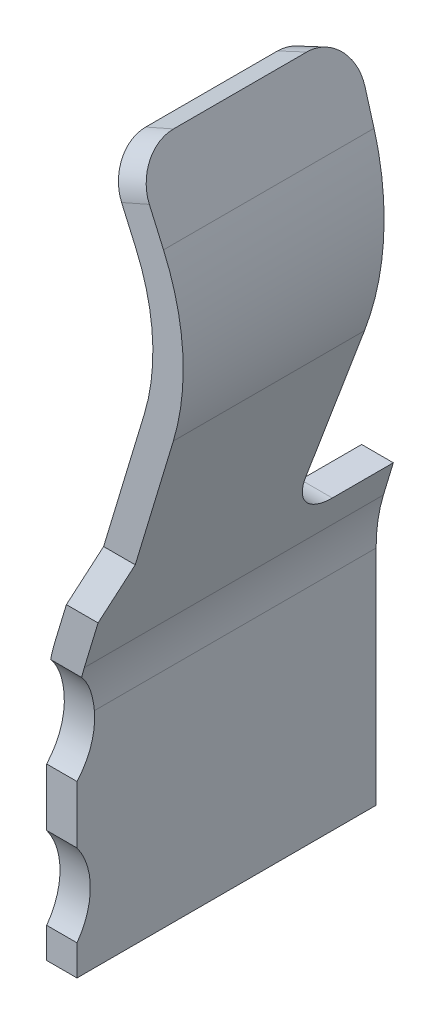
ISO-10303-21;
HEADER;
FILE_DESCRIPTION(('STEP AP214'),'2;1');
FILE_NAME('part.step','',(''),(''),'','','');
FILE_SCHEMA(('AUTOMOTIVE_DESIGN { 1 0 10303 214 1 1 1 1 }'));
ENDSEC;
DATA;
#1=APPLICATION_CONTEXT('core data for automotive mechanical design processes');
#2=APPLICATION_PROTOCOL_DEFINITION('international standard','automotive_design',2000,#1);
#3=PRODUCT_CONTEXT('',#1,'mechanical');
#4=PRODUCT('Part','Part','',(#3));
#5=PRODUCT_RELATED_PRODUCT_CATEGORY('part','',(#4));
#6=PRODUCT_DEFINITION_FORMATION('','',#4);
#7=PRODUCT_DEFINITION_CONTEXT('part definition',#1,'design');
#8=PRODUCT_DEFINITION('design','',#6,#7);
#9=PRODUCT_DEFINITION_SHAPE('','',#8);
#10=(LENGTH_UNIT() NAMED_UNIT(*) SI_UNIT(.MILLI.,.METRE.));
#11=(NAMED_UNIT(*) PLANE_ANGLE_UNIT() SI_UNIT($,.RADIAN.));
#12=(NAMED_UNIT(*) SI_UNIT($,.STERADIAN.) SOLID_ANGLE_UNIT());
#13=UNCERTAINTY_MEASURE_WITH_UNIT(LENGTH_MEASURE(1.E-05),#10,'distance_accuracy_value','');
#14=(GEOMETRIC_REPRESENTATION_CONTEXT(3) GLOBAL_UNCERTAINTY_ASSIGNED_CONTEXT((#13)) GLOBAL_UNIT_ASSIGNED_CONTEXT((#10,
#11,#12)) REPRESENTATION_CONTEXT('',''));
#15=CARTESIAN_POINT('',(0.,0.,0.));
#16=DIRECTION('',(0.,0.,1.));
#17=DIRECTION('',(1.,0.,0.));
#18=AXIS2_PLACEMENT_3D('',#15,#16,#17);
#19=CARTESIAN_POINT('',(-14.55613725867,3.53312166947706,-0.236832722369338));
#20=DIRECTION('',(-0.914255270392897,-0.402239697454475,0.0483789866630426));
#21=DIRECTION('',(0.402711251685505,-0.915327071470026,0.));
#22=AXIS2_PLACEMENT_3D('',#19,#20,#21);
#23=CYLINDRICAL_SURFACE('',#22,0.2);
#24=CARTESIAN_POINT('',(-14.5696414773253,3.50329761180303,-0.434687053017797));
#25=CARTESIAN_POINT('',(-14.6207184044719,3.6193909515076,-0.448650066039084));
#26=CARTESIAN_POINT('',(-14.6589871835182,3.70637250294574,-0.363398989614743));
#27=CARTESIAN_POINT('',(-14.6589871835182,3.70637250294574,-0.235652283248446));
#28=(BOUNDED_CURVE() B_SPLINE_CURVE(3,(#24,#25,#26,#27),.UNSPECIFIED.,.F.,
.F.) B_SPLINE_CURVE_WITH_KNOTS((4,4),(3.0320715031167,4.71238898038462),
.UNSPECIFIED.) CURVE() GEOMETRIC_REPRESENTATION_ITEM() RATIONAL_B_SPLINE_CURVE((1.,
0.778229742533871,0.778229742533871,1.)) REPRESENTATION_ITEM(''));
#29=CARTESIAN_POINT('',(-14.5696414773253,3.50329761180303,-0.434687053017797));
#30=VERTEX_POINT('',#29);
#31=CARTESIAN_POINT('',(-14.6589871835182,3.70637250294574,-0.235652283248446));
#32=VERTEX_POINT('',#31);
#33=EDGE_CURVE('E271',#30,#32,#28,.T.);
#34=ORIENTED_EDGE('',*,*,#33,.F.);
#35=DIRECTION('',(0.914255270392898,0.402239697454473,-0.0483789866630426));
#36=VECTOR('',#35,1.);
#37=CARTESIAN_POINT('',(-38.617177596038,-7.07676024092296,0.837819069551529));
#38=LINE('',#37,#36);
#39=CARTESIAN_POINT('',(-14.7069405380458,3.44289092405021,-0.427421697659669));
#40=VERTEX_POINT('',#39);
#41=EDGE_CURVE('E11',#40,#30,#38,.T.);
#42=ORIENTED_EDGE('',*,*,#41,.F.);
#43=CARTESIAN_POINT('',(-14.7962862442387,3.64596581519291,-0.228386927890318));
#44=CARTESIAN_POINT('',(-14.7962862442387,3.64596581519291,-0.356133634256616));
#45=CARTESIAN_POINT('',(-14.7580174651924,3.55898426375477,-0.441384710680957));
#46=CARTESIAN_POINT('',(-14.7069405380458,3.44289092405021,-0.427421697659669));
#47=(BOUNDED_CURVE() B_SPLINE_CURVE(3,(#43,#44,#45,#46),.UNSPECIFIED.,.F.,
.F.) B_SPLINE_CURVE_WITH_KNOTS((4,4),(1.57079632679495,3.25111380406287),
.UNSPECIFIED.) CURVE() GEOMETRIC_REPRESENTATION_ITEM() RATIONAL_B_SPLINE_CURVE((1.,
0.778229742533869,0.778229742533869,1.)) REPRESENTATION_ITEM(''));
#48=CARTESIAN_POINT('',(-14.7962862442387,3.64596581519291,-0.228386927890318));
#49=VERTEX_POINT('',#48);
#50=EDGE_CURVE('E254',#49,#40,#47,.T.);
#51=ORIENTED_EDGE('',*,*,#50,.F.);
#52=DIRECTION('',(-0.914255270392898,-0.402239697454473,0.0483789866630426));
#53=VECTOR('',#52,1.);
#54=CARTESIAN_POINT('',(-14.6366795090071,3.71618708377106,-0.236832722369339));
#55=LINE('',#54,#53);
#56=EDGE_CURVE('E265',#32,#49,#55,.T.);
#57=ORIENTED_EDGE('',*,*,#56,.F.);
#58=EDGE_LOOP('',(#34,#42,#51,#57));
#59=FACE_BOUND('',#58,.T.);
#60=ADVANCED_FACE('F16',(#59),#23,.T.);
#61=CARTESIAN_POINT('',(-14.5784449331811,3.52330708865174,0.423604352914838));
#62=DIRECTION('',(0.915327071470026,0.402711251685505,0.));
#63=DIRECTION('',(-0.402711251685505,0.915327071470026,0.));
#64=AXIS2_PLACEMENT_3D('',#61,#62,#63);
#65=CYLINDRICAL_SURFACE('',#64,0.2);
#66=CARTESIAN_POINT('',(-14.7157439939016,3.46290040089891,0.423604352914837));
#67=DIRECTION('',(-0.915327071470029,-0.402711251685498,0.));
#68=DIRECTION('',(-0.402711251685498,0.915327071470029,0.));
#69=AXIS2_PLACEMENT_3D('',#66,#67,#68);
#70=CIRCLE('',#69,0.2);
#71=CARTESIAN_POINT('',(-14.7157439939016,3.46290040089891,0.623604352914837));
#72=VERTEX_POINT('',#71);
#73=CARTESIAN_POINT('',(-14.7962862442387,3.64596581519291,0.423604352914837));
#74=VERTEX_POINT('',#73);
#75=EDGE_CURVE('E244',#72,#74,#70,.T.);
#76=ORIENTED_EDGE('',*,*,#75,.F.);
#77=DIRECTION('',(-0.915327071470027,-0.402711251685503,0.));
#78=VECTOR('',#77,1.);
#79=CARTESIAN_POINT('',(-39.3330633966531,-7.36784176638169,0.623604352914803));
#80=LINE('',#79,#78);
#81=CARTESIAN_POINT('',(-14.5784449331811,3.52330708865174,0.623604352914837));
#82=VERTEX_POINT('',#81);
#83=EDGE_CURVE('E27',#82,#72,#80,.T.);
#84=ORIENTED_EDGE('',*,*,#83,.F.);
#85=CARTESIAN_POINT('',(-14.5784449331811,3.52330708865174,0.423604352914838));
#86=DIRECTION('',(0.915327071470029,0.402711251685498,0.));
#87=DIRECTION('',(0.402711251685498,-0.915327071470029,0.));
#88=AXIS2_PLACEMENT_3D('',#85,#86,#87);
#89=CIRCLE('',#88,0.2);
#90=CARTESIAN_POINT('',(-14.6589871835182,3.70637250294574,0.423604352914837));
#91=VERTEX_POINT('',#90);
#92=EDGE_CURVE('E260',#91,#82,#89,.T.);
#93=ORIENTED_EDGE('',*,*,#92,.F.);
#94=DIRECTION('',(0.915327071470027,0.402711251685503,0.));
#95=VECTOR('',#94,1.);
#96=CARTESIAN_POINT('',(-14.6589871835182,3.70637250294574,0.423604352914837));
#97=LINE('',#96,#95);
#98=EDGE_CURVE('E257',#74,#91,#97,.T.);
#99=ORIENTED_EDGE('',*,*,#98,.F.);
#100=EDGE_LOOP('',(#76,#84,#93,#99));
#101=FACE_BOUND('',#100,.T.);
#102=ADVANCED_FACE('F258',(#101),#65,.T.);
#103=CARTESIAN_POINT('',(-43.43,1.65634067151207,-0.212546111318104));
#104=DIRECTION('',(0.,-1.,0.));
#105=DIRECTION('',(0.,0.,-1.));
#106=AXIS2_PLACEMENT_3D('',#103,#104,#105);
#107=PLANE('',#106);
#108=DIRECTION('',(0.,0.,-1.));
#109=VECTOR('',#108,1.);
#110=CARTESIAN_POINT('',(-14.8915034091056,1.65634067151207,-0.740000000000021));
#111=LINE('',#110,#109);
#112=CARTESIAN_POINT('',(-14.8915034091056,1.65634067151207,-0.438042305987955));
#113=VERTEX_POINT('',#112);
#114=CARTESIAN_POINT('',(-14.8915034091056,1.65634067151207,-0.740000000000021));
#115=VERTEX_POINT('',#114);
#116=EDGE_CURVE('E309',#113,#115,#111,.T.);
#117=ORIENTED_EDGE('',*,*,#116,.F.);
#118=DIRECTION('',(1.,0.,0.));
#119=VECTOR('',#118,1.);
#120=CARTESIAN_POINT('',(-14.7348350789415,1.65634067151207,-0.438042305987954));
#121=LINE('',#120,#119);
#122=CARTESIAN_POINT('',(-14.7348350789415,1.65634067151207,-0.438042305987954));
#123=VERTEX_POINT('',#122);
#124=EDGE_CURVE('E293',#113,#123,#121,.T.);
#125=ORIENTED_EDGE('',*,*,#124,.T.);
#126=DIRECTION('',(0.,0.,1.));
#127=VECTOR('',#126,1.);
#128=CARTESIAN_POINT('',(-14.7348350789415,1.65634067151207,-0.74000000000002));
#129=LINE('',#128,#127);
#130=CARTESIAN_POINT('',(-14.7348350789415,1.65634067151207,-0.74000000000002));
#131=VERTEX_POINT('',#130);
#132=EDGE_CURVE('E340',#131,#123,#129,.T.);
#133=ORIENTED_EDGE('',*,*,#132,.F.);
#134=DIRECTION('',(-1.,0.,0.));
#135=VECTOR('',#134,1.);
#136=CARTESIAN_POINT('',(-13.97,1.65634067151207,-0.740000000000019));
#137=LINE('',#136,#135);
#138=EDGE_CURVE('E354',#131,#115,#137,.T.);
#139=ORIENTED_EDGE('',*,*,#138,.T.);
#140=EDGE_LOOP('',(#117,#125,#133,#139));
#141=FACE_BOUND('',#140,.T.);
#142=ADVANCED_FACE('F497',(#141),#107,.F.);
#143=CARTESIAN_POINT('',(-43.43,3.70637250294571,-0.459111687165995));
#144=DIRECTION('',(0.,0.119413416546905,0.992844618230162));
#145=DIRECTION('',(1.,0.,0.));
#146=AXIS2_PLACEMENT_3D('',#143,#144,#145);
#147=PLANE('',#146);
#148=DIRECTION('',(0.286748539926818,0.951150986717315,-0.11439875574724));
#149=VECTOR('',#148,1.);
#150=CARTESIAN_POINT('',(-14.7658776351119,1.55337185451571,-0.200161637444148));
#151=LINE('',#150,#149);
#152=CARTESIAN_POINT('',(-14.6673399772696,1.88022335482146,-0.239473382341922));
#153=VERTEX_POINT('',#152);
#154=CARTESIAN_POINT('',(-14.4597982395462,2.56864369924933,-0.322272466749581));
#155=VERTEX_POINT('',#154);
#156=EDGE_CURVE('E417',#153,#155,#151,.T.);
#157=ORIENTED_EDGE('',*,*,#156,.F.);
#158=DIRECTION('',(-1.,0.,0.));
#159=VECTOR('',#158,1.);
#160=CARTESIAN_POINT('',(-14.8915034091056,1.88022335482146,-0.239473382341922));
#161=LINE('',#160,#159);
#162=CARTESIAN_POINT('',(-14.8240083074336,1.88022335482146,-0.239473382341922));
#163=VERTEX_POINT('',#162);
#164=EDGE_CURVE('E323',#153,#163,#161,.T.);
#165=ORIENTED_EDGE('',*,*,#164,.T.);
#166=DIRECTION('',(-0.28674853992682,-0.951150986717314,0.11439875574724));
#167=VECTOR('',#166,1.);
#168=CARTESIAN_POINT('',(-14.9096639548885,1.59610175610151,-0.205300934614505));
#169=LINE('',#168,#167);
#170=CARTESIAN_POINT('',(-14.6034137359037,2.61194022573825,-0.327479914176623));
#171=VERTEX_POINT('',#170);
#172=EDGE_CURVE('E526',#171,#163,#169,.T.);
#173=ORIENTED_EDGE('',*,*,#172,.F.);
#174=CARTESIAN_POINT('',(-14.6455233068166,3.30329498734983,-0.410631932744419));
#175=CARTESIAN_POINT('',(-14.5485450102924,3.08287189317973,-0.384120760424612));
#176=CARTESIAN_POINT('',(-14.5339044888234,2.84250387207174,-0.355210731501567));
#177=CARTESIAN_POINT('',(-14.6034137359037,2.61194022573825,-0.327479914176623));
#178=(BOUNDED_CURVE() B_SPLINE_CURVE(3,(#174,#175,#176,#177),.UNSPECIFIED.,.F.,
.F.) B_SPLINE_CURVE_WITH_KNOTS((4,4),(4.29791199977039,5.00519872138853),
.UNSPECIFIED.) CURVE() GEOMETRIC_REPRESENTATION_ITEM() RATIONAL_B_SPLINE_CURVE((1.,
0.958744787021091,0.958744787021091,1.)) REPRESENTATION_ITEM(''));
#179=CARTESIAN_POINT('',(-14.6455233068166,3.30329498734983,-0.410631932744419));
#180=VERTEX_POINT('',#179);
#181=EDGE_CURVE('E289',#180,#171,#178,.T.);
#182=ORIENTED_EDGE('',*,*,#181,.F.);
#183=DIRECTION('',(0.400292818236851,-0.909830186054405,0.109428936813833));
#184=VECTOR('',#183,1.);
#185=CARTESIAN_POINT('',(-14.6599508196559,3.33608744850051,-0.414576013974334));
#186=LINE('',#185,#184);
#187=EDGE_CURVE('E348',#40,#180,#186,.T.);
#188=ORIENTED_EDGE('',*,*,#187,.F.);
#189=ORIENTED_EDGE('',*,*,#41,.T.);
#190=DIRECTION('',(-0.40029281823685,0.909830186054405,-0.109428936813833));
#191=VECTOR('',#190,1.);
#192=CARTESIAN_POINT('',(-14.5223335100882,3.39577078475993,-0.421754368938235));
#193=LINE('',#192,#191);
#194=CARTESIAN_POINT('',(-14.5082242460961,3.36370167510267,-0.417897288102547));
#195=VERTEX_POINT('',#194);
#196=EDGE_CURVE('E279',#195,#30,#193,.T.);
#197=ORIENTED_EDGE('',*,*,#196,.F.);
#198=CARTESIAN_POINT('',(-14.4597982395462,2.56864369924933,-0.322272466749581));
#199=CARTESIAN_POINT('',(-14.379862605404,2.83379189253285,-0.354162906673267));
#200=CARTESIAN_POINT('',(-14.3966992050933,3.11021511680704,-0.387409439934769));
#201=CARTESIAN_POINT('',(-14.5082242460961,3.36370167510267,-0.417897288102547));
#202=(BOUNDED_CURVE() B_SPLINE_CURVE(3,(#198,#199,#200,#201),.UNSPECIFIED.,.F.,
.F.) B_SPLINE_CURVE_WITH_KNOTS((4,4),(1.27798658579106,1.98527330740919),
.UNSPECIFIED.) CURVE() GEOMETRIC_REPRESENTATION_ITEM() RATIONAL_B_SPLINE_CURVE((1.,
0.958744787021091,0.958744787021091,1.)) REPRESENTATION_ITEM(''));
#203=EDGE_CURVE('E418',#155,#195,#202,.T.);
#204=ORIENTED_EDGE('',*,*,#203,.F.);
#205=EDGE_LOOP('',(#157,#165,#173,#182,#188,#189,#197,#204));
#206=FACE_BOUND('',#205,.T.);
#207=ADVANCED_FACE('F504',(#206),#147,.F.);
#208=CARTESIAN_POINT('',(-43.43,1.94413292378283,0.623604352914797));
#209=DIRECTION('',(0.,0.,-1.));
#210=DIRECTION('',(0.,-1.,0.));
#211=AXIS2_PLACEMENT_3D('',#208,#209,#210);
#212=PLANE('',#211);
#213=DIRECTION('',(0.4027112516855,-0.915327071470028,0.));
#214=VECTOR('',#213,1.);
#215=CARTESIAN_POINT('',(-14.5082242460961,3.36370167510267,0.623604352914838));
#216=LINE('',#215,#214);
#217=CARTESIAN_POINT('',(-14.5082242460961,3.36370167510267,0.623604352914838));
#218=VERTEX_POINT('',#217);
#219=EDGE_CURVE('E290',#82,#218,#216,.T.);
#220=ORIENTED_EDGE('',*,*,#219,.F.);
#221=ORIENTED_EDGE('',*,*,#83,.T.);
#222=DIRECTION('',(-0.402711251685501,0.915327071470028,0.));
#223=VECTOR('',#222,1.);
#224=CARTESIAN_POINT('',(-14.6455233068166,3.30329498734984,0.623604352914837));
#225=LINE('',#224,#223);
#226=CARTESIAN_POINT('',(-14.6455233068166,3.30329498734983,0.623604352914837));
#227=VERTEX_POINT('',#226);
#228=EDGE_CURVE('E251',#227,#72,#225,.T.);
#229=ORIENTED_EDGE('',*,*,#228,.F.);
#230=CARTESIAN_POINT('',(-15.5608503782866,2.90058373566433,0.623604352914836));
#231=DIRECTION('',(0.,0.,1.));
#232=DIRECTION('',(-1.,0.,0.));
#233=AXIS2_PLACEMENT_3D('',#230,#231,#232);
#234=CIRCLE('',#233,1.);
#235=CARTESIAN_POINT('',(-14.6034137359037,2.61194022573825,0.623604352914837));
#236=VERTEX_POINT('',#235);
#237=EDGE_CURVE('E288',#236,#227,#234,.T.);
#238=ORIENTED_EDGE('',*,*,#237,.F.);
#239=DIRECTION('',(0.28864350992609,0.957436642382956,0.));
#240=VECTOR('',#239,1.);
#241=CARTESIAN_POINT('',(-14.927436642383,1.53714937485737,0.623604352914836));
#242=LINE('',#241,#240);
#243=CARTESIAN_POINT('',(-14.8047411502284,1.94413292378283,0.623604352914837));
#244=VERTEX_POINT('',#243);
#245=EDGE_CURVE('E525',#244,#236,#242,.T.);
#246=ORIENTED_EDGE('',*,*,#245,.F.);
#247=DIRECTION('',(1.,0.,0.));
#248=VECTOR('',#247,1.);
#249=CARTESIAN_POINT('',(-43.43,1.94413292378283,0.623604352914797));
#250=LINE('',#249,#248);
#251=CARTESIAN_POINT('',(-14.6480728200643,1.94413292378283,0.623604352914837));
#252=VERTEX_POINT('',#251);
#253=EDGE_CURVE('E357',#244,#252,#250,.T.);
#254=ORIENTED_EDGE('',*,*,#253,.T.);
#255=DIRECTION('',(-0.288643509926088,-0.957436642382956,0.));
#256=VECTOR('',#255,1.);
#257=CARTESIAN_POINT('',(-14.7838211460255,1.49385284836845,0.623604352914837));
#258=LINE('',#257,#256);
#259=CARTESIAN_POINT('',(-14.4597982395462,2.56864369924933,0.623604352914837));
#260=VERTEX_POINT('',#259);
#261=EDGE_CURVE('E433',#260,#252,#258,.T.);
#262=ORIENTED_EDGE('',*,*,#261,.F.);
#263=CARTESIAN_POINT('',(-15.5608503782866,2.90058373566433,0.623604352914836));
#264=DIRECTION('',(0.,0.,-1.));
#265=DIRECTION('',(-1.,0.,0.));
#266=AXIS2_PLACEMENT_3D('',#263,#264,#265);
#267=CIRCLE('',#266,1.15);
#268=EDGE_CURVE('E387',#218,#260,#267,.T.);
#269=ORIENTED_EDGE('',*,*,#268,.F.);
#270=EDGE_LOOP('',(#220,#221,#229,#238,#246,#254,#262,#269));
#271=FACE_BOUND('',#270,.T.);
#272=ADVANCED_FACE('F733',(#271),#212,.F.);
#273=CARTESIAN_POINT('',(-43.43,1.7003498353216,0.749999999999972));
#274=DIRECTION('',(0.,-0.460287319631494,-0.887770005906065));
#275=DIRECTION('',(0.,-0.887770005906065,0.460287319631494));
#276=AXIS2_PLACEMENT_3D('',#273,#274,#275);
#277=PLANE('',#276);
#278=ORIENTED_EDGE('',*,*,#253,.F.);
#279=DIRECTION('',(0.258541028225373,0.857586072334425,-0.444637678635293));
#280=VECTOR('',#279,1.);
#281=CARTESIAN_POINT('',(-14.7464234383064,2.13757401070795,0.523309818502746));
#282=LINE('',#281,#280);
#283=CARTESIAN_POINT('',(-14.8724210876793,1.7196371362757,0.73999999999998));
#284=VERTEX_POINT('',#283);
#285=EDGE_CURVE('E521',#284,#244,#282,.T.);
#286=ORIENTED_EDGE('',*,*,#285,.F.);
#287=DIRECTION('',(-1.,0.,0.));
#288=VECTOR('',#287,1.);
#289=CARTESIAN_POINT('',(-13.97,1.7196371362757,0.739999999999981));
#290=LINE('',#289,#288);
#291=CARTESIAN_POINT('',(-14.7157527575152,1.7196371362757,0.73999999999998));
#292=VERTEX_POINT('',#291);
#293=EDGE_CURVE('E377',#292,#284,#290,.T.);
#294=ORIENTED_EDGE('',*,*,#293,.F.);
#295=DIRECTION('',(-0.258541028225372,-0.857586072334425,0.444637678635293));
#296=VECTOR('',#295,1.);
#297=CARTESIAN_POINT('',(-14.6002273619162,2.10283732290249,0.541319952677682));
#298=LINE('',#297,#296);
#299=EDGE_CURVE('E424',#252,#292,#298,.T.);
#300=ORIENTED_EDGE('',*,*,#299,.F.);
#301=EDGE_LOOP('',(#278,#286,#294,#300));
#302=FACE_BOUND('',#301,.T.);
#303=ADVANCED_FACE('F728',(#302),#277,.F.);
#304=CARTESIAN_POINT('',(-13.97,1.24850586493128,0.739999999999981));
#305=DIRECTION('',(0.,0.,-1.));
#306=DIRECTION('',(0.,-1.,0.));
#307=AXIS2_PLACEMENT_3D('',#304,#305,#306);
#308=PLANE('',#307);
#309=DIRECTION('',(0.,1.,0.));
#310=VECTOR('',#309,1.);
#311=CARTESIAN_POINT('',(-14.82,0.145965815192914,0.73999999999998));
#312=LINE('',#311,#310);
#313=CARTESIAN_POINT('',(-14.82,0.145965815192914,0.73999999999998));
#314=VERTEX_POINT('',#313);
#315=CARTESIAN_POINT('',(-14.82,0.296740599868486,0.73999999999998));
#316=VERTEX_POINT('',#315);
#317=EDGE_CURVE('E388',#314,#316,#312,.T.);
#318=ORIENTED_EDGE('',*,*,#317,.T.);
#319=DIRECTION('',(-1.,0.,0.));
#320=VECTOR('',#319,1.);
#321=CARTESIAN_POINT('',(-43.43,0.296740599868486,0.73999999999994));
#322=LINE('',#321,#320);
#323=CARTESIAN_POINT('',(-14.97,0.296740599868486,0.739999999999979));
#324=VERTEX_POINT('',#323);
#325=EDGE_CURVE('E330',#316,#324,#322,.T.);
#326=ORIENTED_EDGE('',*,*,#325,.T.);
#327=DIRECTION('',(0.,-1.,0.));
#328=VECTOR('',#327,1.);
#329=CARTESIAN_POINT('',(-14.97,0.145965815192914,0.739999999999979));
#330=LINE('',#329,#328);
#331=CARTESIAN_POINT('',(-14.97,0.145965815192914,0.739999999999979));
#332=VERTEX_POINT('',#331);
#333=EDGE_CURVE('E335',#324,#332,#330,.T.);
#334=ORIENTED_EDGE('',*,*,#333,.T.);
#335=DIRECTION('',(1.,0.,0.));
#336=VECTOR('',#335,1.);
#337=CARTESIAN_POINT('',(-14.82,0.145965815192914,0.73999999999998));
#338=LINE('',#337,#336);
#339=EDGE_CURVE('E312',#332,#314,#338,.T.);
#340=ORIENTED_EDGE('',*,*,#339,.T.);
#341=EDGE_LOOP('',(#318,#326,#334,#340));
#342=FACE_BOUND('',#341,.T.);
#343=ADVANCED_FACE('F732',(#342),#308,.F.);
#344=CARTESIAN_POINT('',(-13.97,1.24850586493128,-0.740000000000019));
#345=DIRECTION('',(0.,0.,-1.));
#346=DIRECTION('',(0.,-1.,0.));
#347=AXIS2_PLACEMENT_3D('',#344,#345,#346);
#348=PLANE('',#347);
#349=ORIENTED_EDGE('',*,*,#138,.F.);
#350=DIRECTION('',(0.288643509926088,0.957436642382956,0.));
#351=VECTOR('',#350,1.);
#352=CARTESIAN_POINT('',(-14.7838211460255,1.49385284836845,-0.74000000000002));
#353=LINE('',#352,#351);
#354=CARTESIAN_POINT('',(-14.7838211460255,1.49385284836845,-0.74000000000002));
#355=VERTEX_POINT('',#354);
#356=EDGE_CURVE('E337',#355,#131,#353,.T.);
#357=ORIENTED_EDGE('',*,*,#356,.F.);
#358=CARTESIAN_POINT('',(-13.97,1.24850586493128,-0.740000000000019));
#359=DIRECTION('',(0.,0.,-1.));
#360=DIRECTION('',(1.,0.,0.));
#361=AXIS2_PLACEMENT_3D('',#358,#359,#360);
#362=CIRCLE('',#361,0.85);
#363=CARTESIAN_POINT('',(-14.82,1.24850586493128,-0.74000000000002));
#364=VERTEX_POINT('',#363);
#365=EDGE_CURVE('E299',#364,#355,#362,.T.);
#366=ORIENTED_EDGE('',*,*,#365,.F.);
#367=DIRECTION('',(0.,1.,0.));
#368=VECTOR('',#367,1.);
#369=CARTESIAN_POINT('',(-14.82,0.145965815192914,-0.74000000000002));
#370=LINE('',#369,#368);
#371=CARTESIAN_POINT('',(-14.82,0.145965815192914,-0.74000000000002));
#372=VERTEX_POINT('',#371);
#373=EDGE_CURVE('E304',#372,#364,#370,.T.);
#374=ORIENTED_EDGE('',*,*,#373,.F.);
#375=DIRECTION('',(1.,0.,0.));
#376=VECTOR('',#375,1.);
#377=CARTESIAN_POINT('',(-14.82,0.145965815192914,-0.74000000000002));
#378=LINE('',#377,#376);
#379=CARTESIAN_POINT('',(-14.97,0.145965815192914,-0.740000000000021));
#380=VERTEX_POINT('',#379);
#381=EDGE_CURVE('E402',#380,#372,#378,.T.);
#382=ORIENTED_EDGE('',*,*,#381,.F.);
#383=DIRECTION('',(0.,-1.,0.));
#384=VECTOR('',#383,1.);
#385=CARTESIAN_POINT('',(-14.97,0.145965815192914,-0.740000000000021));
#386=LINE('',#385,#384);
#387=CARTESIAN_POINT('',(-14.97,1.24850586493128,-0.740000000000021));
#388=VERTEX_POINT('',#387);
#389=EDGE_CURVE('E42',#388,#380,#386,.T.);
#390=ORIENTED_EDGE('',*,*,#389,.F.);
#391=CARTESIAN_POINT('',(-13.97,1.24850586493128,-0.740000000000019));
#392=DIRECTION('',(0.,0.,1.));
#393=DIRECTION('',(1.,0.,0.));
#394=AXIS2_PLACEMENT_3D('',#391,#392,#393);
#395=CIRCLE('',#394,1.);
#396=CARTESIAN_POINT('',(-14.927436642383,1.53714937485737,-0.740000000000021));
#397=VERTEX_POINT('',#396);
#398=EDGE_CURVE('E336',#397,#388,#395,.T.);
#399=ORIENTED_EDGE('',*,*,#398,.F.);
#400=DIRECTION('',(-0.28864350992609,-0.957436642382956,0.));
#401=VECTOR('',#400,1.);
#402=CARTESIAN_POINT('',(-14.927436642383,1.53714937485737,-0.740000000000021));
#403=LINE('',#402,#401);
#404=EDGE_CURVE('E305',#115,#397,#403,.T.);
#405=ORIENTED_EDGE('',*,*,#404,.F.);
#406=EDGE_LOOP('',(#349,#357,#366,#374,#382,#390,#399,#405));
#407=FACE_BOUND('',#406,.T.);
#408=ADVANCED_FACE('F742',(#407),#348,.T.);
#409=CARTESIAN_POINT('',(-14.97,0.145965815192914,-0.740000000000021));
#410=DIRECTION('',(1.,0.,0.));
#411=DIRECTION('',(0.,1.,0.));
#412=AXIS2_PLACEMENT_3D('',#409,#410,#411);
#413=PLANE('',#412);
#414=DIRECTION('',(0.,-1.,0.));
#415=VECTOR('',#414,1.);
#416=CARTESIAN_POINT('',(-14.97,0.145965815192914,0.739999999999979));
#417=LINE('',#416,#415);
#418=CARTESIAN_POINT('',(-14.97,0.988055123608201,0.739999999999979));
#419=VERTEX_POINT('',#418);
#420=CARTESIAN_POINT('',(-14.97,0.703259400131467,0.739999999999979));
#421=VERTEX_POINT('',#420);
#422=EDGE_CURVE('E317',#419,#421,#417,.T.);
#423=ORIENTED_EDGE('',*,*,#422,.F.);
#424=CARTESIAN_POINT('',(-14.97,1.21669179396546,0.995153761033096));
#425=DIRECTION('',(1.,0.,0.));
#426=DIRECTION('',(0.,1.,0.));
#427=AXIS2_PLACEMENT_3D('',#424,#425,#426);
#428=CIRCLE('',#427,0.342604974863759);
#429=CARTESIAN_POINT('',(-14.97,1.24850586493128,0.654029100989324));
#430=VERTEX_POINT('',#429);
#431=EDGE_CURVE('E401',#419,#430,#428,.T.);
#432=ORIENTED_EDGE('',*,*,#431,.T.);
#433=DIRECTION('',(0.,0.,1.));
#434=VECTOR('',#433,1.);
#435=CARTESIAN_POINT('',(-14.97,1.24850586493128,-0.740000000000021));
#436=LINE('',#435,#434);
#437=EDGE_CURVE('E397',#388,#430,#436,.T.);
#438=ORIENTED_EDGE('',*,*,#437,.F.);
#439=ORIENTED_EDGE('',*,*,#389,.T.);
#440=DIRECTION('',(0.,0.,1.));
#441=VECTOR('',#440,1.);
#442=CARTESIAN_POINT('',(-14.97,0.145965815192914,-0.740000000000021));
#443=LINE('',#442,#441);
#444=EDGE_CURVE('E316',#380,#332,#443,.T.);
#445=ORIENTED_EDGE('',*,*,#444,.T.);
#446=ORIENTED_EDGE('',*,*,#333,.F.);
#447=CARTESIAN_POINT('',(-14.97,0.499999999999977,1.0194268345702));
#448=DIRECTION('',(1.,0.,0.));
#449=DIRECTION('',(0.,1.,0.));
#450=AXIS2_PLACEMENT_3D('',#447,#448,#449);
#451=CIRCLE('',#450,0.345533991988848);
#452=EDGE_CURVE('E324',#324,#421,#451,.T.);
#453=ORIENTED_EDGE('',*,*,#452,.T.);
#454=EDGE_LOOP('',(#423,#432,#438,#439,#445,#446,#453));
#455=FACE_BOUND('',#454,.T.);
#456=ADVANCED_FACE('F490',(#455),#413,.F.);
#457=CARTESIAN_POINT('',(-13.97,1.24850586493128,-0.740000000000019));
#458=DIRECTION('',(0.,0.,1.));
#459=DIRECTION('',(-1.,0.,0.));
#460=AXIS2_PLACEMENT_3D('',#457,#458,#459);
#461=CYLINDRICAL_SURFACE('',#460,1.);
#462=ORIENTED_EDGE('',*,*,#437,.T.);
#463=CARTESIAN_POINT('',(-14.97,1.24850586493127,0.654029100989324));
#464=CARTESIAN_POINT('',(-14.9700000740736,1.25306932177748,0.654454497923835));
#465=CARTESIAN_POINT('',(-14.9699687647214,1.25762446546712,0.654969794425774));
#466=CARTESIAN_POINT('',(-14.9698448349043,1.26669234380872,0.656178662703507));
#467=CARTESIAN_POINT('',(-14.969752450797,1.27120517419842,0.656871540938563));
#468=CARTESIAN_POINT('',(-14.9695080867068,1.28018764830056,0.658435530000101));
#469=CARTESIAN_POINT('',(-14.9693562428961,1.28465736694881,0.659306231418194));
#470=CARTESIAN_POINT('',(-14.968994777031,1.29355289226453,0.661225514697385));
#471=CARTESIAN_POINT('',(-14.9687851944591,1.29797872680563,0.66227397481712));
#472=CARTESIAN_POINT('',(-14.9683100279271,1.30678583476397,0.664548502475786));
#473=CARTESIAN_POINT('',(-14.968044392526,1.31116706334694,0.665774732832754));
#474=CARTESIAN_POINT('',(-14.9674588915288,1.31988437499395,0.668404514864849));
#475=CARTESIAN_POINT('',(-14.9671388909946,1.32422031651338,0.669808505488944));
#476=CARTESIAN_POINT('',(-14.9664464106962,1.33284654509273,0.672793524574298));
#477=CARTESIAN_POINT('',(-14.9660737213731,1.33713657245114,0.67437525453736));
#478=CARTESIAN_POINT('',(-14.9652776024185,1.34567049059148,0.677715533217567));
#479=CARTESIAN_POINT('',(-14.964853898673,1.34991398511754,0.679475028174295));
#480=CARTESIAN_POINT('',(-14.9639632184939,1.35830019523904,0.683146652073494));
#481=CARTESIAN_POINT('',(-14.9634965071956,1.36244335249443,0.685057836907499));
#482=CARTESIAN_POINT('',(-14.962523128602,1.37063194178074,0.6890335315101));
#483=CARTESIAN_POINT('',(-14.9620166121166,1.3746776733665,0.691097460992356));
#484=CARTESIAN_POINT('',(-14.9609671316824,1.38267128376232,0.695378434355305));
#485=CARTESIAN_POINT('',(-14.9604242473526,1.3866193519919,0.69759514404689));
#486=CARTESIAN_POINT('',(-14.9593054429822,1.39441764648526,0.702181418874191));
#487=CARTESIAN_POINT('',(-14.9587295429944,1.39826793013232,0.704550891332612));
#488=CARTESIAN_POINT('',(-14.957548029628,1.40587073759695,0.709442454924467));
#489=CARTESIAN_POINT('',(-14.9569423891828,1.40962316741917,0.711964685588729));
#490=CARTESIAN_POINT('',(-14.9557046207364,1.4170304504751,0.717161525963165));
#491=CARTESIAN_POINT('',(-14.955072431473,1.42068504210779,0.719836493879691));
#492=CARTESIAN_POINT('',(-14.9537847065422,1.42789683764576,0.725338623347788));
#493=CARTESIAN_POINT('',(-14.9531290884707,1.43145359950846,0.728166344681211));
#494=CARTESIAN_POINT('',(-14.9517975159458,1.43847023752972,0.733973670299352));
#495=CARTESIAN_POINT('',(-14.951121470501,1.44192948379825,0.736954014976151));
#496=CARTESIAN_POINT('',(-14.9504391181347,1.44532846432271,0.73999999999998));
#497=B_SPLINE_CURVE_WITH_KNOTS('',3,(#463,#464,#465,#466,#467,#468,#469,#470,#471,#472,#473,
#474,#475,#476,#477,#478,#479,#480,#481,#482,#483,#484,#485,#486,#487,#488,#489,#490,#491,#492,
#493,#494,#495,#496),.UNSPECIFIED.,.F.,.F.,(4,2,2,2,2,2,2,2,2,2,2,2,2,2,2,2,4),(0.,
0.013748827736232,0.0274447569667543,0.0411095020469267,0.0547649260984996,0.0684329369744623,
0.0821353821572885,0.0958939450956066,0.109730045405059,0.123485924962941,0.137191991355335,
0.150868974599205,0.164537737053089,0.17821917870054,0.191934141578145,0.205703315519925,
0.219547147320743),.UNSPECIFIED.);
#498=CARTESIAN_POINT('',(-14.9504391181347,1.44532846432271,0.739999999999979));
#499=VERTEX_POINT('',#498);
#500=EDGE_CURVE('E331',#430,#499,#497,.T.);
#501=ORIENTED_EDGE('',*,*,#500,.T.);
#502=CARTESIAN_POINT('',(-13.97,1.24850586493128,0.739999999999981));
#503=DIRECTION('',(0.,0.,1.));
#504=DIRECTION('',(1.,0.,0.));
#505=AXIS2_PLACEMENT_3D('',#502,#503,#504);
#506=CIRCLE('',#505,1.);
#507=CARTESIAN_POINT('',(-14.927436642383,1.53714937485737,0.739999999999979));
#508=VERTEX_POINT('',#507);
#509=EDGE_CURVE('E457',#508,#499,#506,.T.);
#510=ORIENTED_EDGE('',*,*,#509,.F.);
#511=DIRECTION('',(0.,0.,1.));
#512=VECTOR('',#511,1.);
#513=CARTESIAN_POINT('',(-14.927436642383,1.53714937485737,-0.740000000000021));
#514=LINE('',#513,#512);
#515=EDGE_CURVE('E283',#397,#508,#514,.T.);
#516=ORIENTED_EDGE('',*,*,#515,.F.);
#517=ORIENTED_EDGE('',*,*,#398,.T.);
#518=EDGE_LOOP('',(#462,#501,#510,#516,#517));
#519=FACE_BOUND('',#518,.T.);
#520=ADVANCED_FACE('F480',(#519),#461,.T.);
#521=CARTESIAN_POINT('',(-14.927436642383,1.53714937485737,-0.740000000000021));
#522=DIRECTION('',(0.957436642382956,-0.28864350992609,0.));
#523=DIRECTION('',(0.,0.,-1.));
#524=AXIS2_PLACEMENT_3D('',#521,#522,#523);
#525=PLANE('',#524);
#526=ORIENTED_EDGE('',*,*,#172,.T.);
#527=CARTESIAN_POINT('',(-14.8240083074336,1.88022335482146,-0.239473382341922));
#528=CARTESIAN_POINT('',(-14.8263982742986,1.87229578405696,-0.238519901512672));
#529=CARTESIAN_POINT('',(-14.8288011555845,1.86432537588468,-0.238042305987954));
#530=CARTESIAN_POINT('',(-14.8312083468218,1.85634067151208,-0.238042305987954));
#531=(BOUNDED_CURVE() B_SPLINE_CURVE(3,(#527,#528,#529,#530),.UNSPECIFIED.,.F.,
.F.) B_SPLINE_CURVE_WITH_KNOTS((4,4),(4.59268992994791,4.71238898038469),
.UNSPECIFIED.) CURVE() GEOMETRIC_REPRESENTATION_ITEM() RATIONAL_B_SPLINE_CURVE((1.,
0.998806367803328,0.998806367803328,1.)) REPRESENTATION_ITEM(''));
#532=CARTESIAN_POINT('',(-14.8312083468218,1.85634067151208,-0.238042305987954));
#533=VERTEX_POINT('',#532);
#534=EDGE_CURVE('E318',#163,#533,#531,.T.);
#535=ORIENTED_EDGE('',*,*,#534,.T.);
#536=CARTESIAN_POINT('',(-14.8312083468218,1.85634067151208,-0.238042305987954));
#537=CARTESIAN_POINT('',(-14.8665283765635,1.73918338398669,-0.238042305987954));
#538=CARTESIAN_POINT('',(-14.8915034091056,1.65634067151208,-0.320885018462573));
#539=CARTESIAN_POINT('',(-14.8915034091056,1.65634067151207,-0.438042305987955));
#540=(BOUNDED_CURVE() B_SPLINE_CURVE(3,(#536,#537,#538,#539),.UNSPECIFIED.,.F.,
.F.) B_SPLINE_CURVE_WITH_KNOTS((4,4),(4.71238898038469,6.28318530717959),
.UNSPECIFIED.) CURVE() GEOMETRIC_REPRESENTATION_ITEM() RATIONAL_B_SPLINE_CURVE((1.,
0.804737854124365,0.804737854124365,1.)) REPRESENTATION_ITEM(''));
#541=EDGE_CURVE('E297',#533,#113,#540,.T.);
#542=ORIENTED_EDGE('',*,*,#541,.T.);
#543=ORIENTED_EDGE('',*,*,#116,.T.);
#544=ORIENTED_EDGE('',*,*,#404,.T.);
#545=ORIENTED_EDGE('',*,*,#515,.T.);
#546=DIRECTION('',(-0.28864350992609,-0.957436642382956,0.));
#547=VECTOR('',#546,1.);
#548=CARTESIAN_POINT('',(-14.927436642383,1.53714937485737,0.739999999999979));
#549=LINE('',#548,#547);
#550=EDGE_CURVE('E384',#284,#508,#549,.T.);
#551=ORIENTED_EDGE('',*,*,#550,.F.);
#552=ORIENTED_EDGE('',*,*,#285,.T.);
#553=ORIENTED_EDGE('',*,*,#245,.T.);
#554=DIRECTION('',(0.,0.,1.));
#555=VECTOR('',#554,1.);
#556=CARTESIAN_POINT('',(-14.6034137359037,2.61194022573825,-0.74000000000002));
#557=LINE('',#556,#555);
#558=EDGE_CURVE('E285',#171,#236,#557,.T.);
#559=ORIENTED_EDGE('',*,*,#558,.F.);
#560=EDGE_LOOP('',(#526,#535,#542,#543,#544,#545,#551,#552,#553,#559));
#561=FACE_BOUND('',#560,.T.);
#562=ADVANCED_FACE('F489',(#561),#525,.F.);
#563=CARTESIAN_POINT('',(-15.5608503782866,2.90058373566433,-0.740000000000021));
#564=DIRECTION('',(0.,0.,1.));
#565=DIRECTION('',(-1.,0.,0.));
#566=AXIS2_PLACEMENT_3D('',#563,#564,#565);
#567=CYLINDRICAL_SURFACE('',#566,1.);
#568=DIRECTION('',(0.,0.,1.));
#569=VECTOR('',#568,1.);
#570=CARTESIAN_POINT('',(-14.6455233068166,3.30329498734983,-0.74000000000002));
#571=LINE('',#570,#569);
#572=EDGE_CURVE('E345',#180,#227,#571,.T.);
#573=ORIENTED_EDGE('',*,*,#572,.F.);
#574=ORIENTED_EDGE('',*,*,#181,.T.);
#575=ORIENTED_EDGE('',*,*,#558,.T.);
#576=ORIENTED_EDGE('',*,*,#237,.T.);
#577=EDGE_LOOP('',(#573,#574,#575,#576));
#578=FACE_BOUND('',#577,.T.);
#579=ADVANCED_FACE('F18',(#578),#567,.F.);
#580=CARTESIAN_POINT('',(-14.6455233068166,3.30329498734984,-0.74000000000002));
#581=DIRECTION('',(0.915327071470028,0.402711251685501,0.));
#582=DIRECTION('',(0.,0.,-1.));
#583=AXIS2_PLACEMENT_3D('',#580,#581,#582);
#584=PLANE('',#583);
#585=ORIENTED_EDGE('',*,*,#228,.T.);
#586=ORIENTED_EDGE('',*,*,#75,.T.);
#587=DIRECTION('',(0.,0.,1.));
#588=VECTOR('',#587,1.);
#589=CARTESIAN_POINT('',(-14.7962862442387,3.64596581519291,-0.740000000000021));
#590=LINE('',#589,#588);
#591=EDGE_CURVE('E249',#49,#74,#590,.T.);
#592=ORIENTED_EDGE('',*,*,#591,.F.);
#593=ORIENTED_EDGE('',*,*,#50,.T.);
#594=ORIENTED_EDGE('',*,*,#187,.T.);
#595=ORIENTED_EDGE('',*,*,#572,.T.);
#596=EDGE_LOOP('',(#585,#586,#592,#593,#594,#595));
#597=FACE_BOUND('',#596,.T.);
#598=ADVANCED_FACE('F246',(#597),#584,.F.);
#599=CARTESIAN_POINT('',(-14.6589871835182,3.70637250294574,-0.74000000000002));
#600=DIRECTION('',(0.402711251685503,-0.915327071470027,0.));
#601=DIRECTION('',(0.,0.,-1.));
#602=AXIS2_PLACEMENT_3D('',#599,#600,#601);
#603=PLANE('',#602);
#604=ORIENTED_EDGE('',*,*,#591,.T.);
#605=ORIENTED_EDGE('',*,*,#98,.T.);
#606=DIRECTION('',(0.,0.,1.));
#607=VECTOR('',#606,1.);
#608=CARTESIAN_POINT('',(-14.6589871835182,3.70637250294574,-0.74000000000002));
#609=LINE('',#608,#607);
#610=EDGE_CURVE('E353',#32,#91,#609,.T.);
#611=ORIENTED_EDGE('',*,*,#610,.F.);
#612=ORIENTED_EDGE('',*,*,#56,.T.);
#613=EDGE_LOOP('',(#604,#605,#611,#612));
#614=FACE_BOUND('',#613,.T.);
#615=ADVANCED_FACE('F268',(#614),#603,.F.);
#616=CARTESIAN_POINT('',(-14.5082242460961,3.36370167510267,-0.74000000000002));
#617=DIRECTION('',(-0.915327071470028,-0.4027112516855,0.));
#618=DIRECTION('',(-0.4027112516855,0.915327071470028,0.));
#619=AXIS2_PLACEMENT_3D('',#616,#617,#618);
#620=PLANE('',#619);
#621=ORIENTED_EDGE('',*,*,#610,.T.);
#622=ORIENTED_EDGE('',*,*,#92,.T.);
#623=ORIENTED_EDGE('',*,*,#219,.T.);
#624=DIRECTION('',(0.,0.,1.));
#625=VECTOR('',#624,1.);
#626=CARTESIAN_POINT('',(-14.5082242460961,3.36370167510267,-0.74000000000002));
#627=LINE('',#626,#625);
#628=EDGE_CURVE('E394',#195,#218,#627,.T.);
#629=ORIENTED_EDGE('',*,*,#628,.F.);
#630=ORIENTED_EDGE('',*,*,#196,.T.);
#631=ORIENTED_EDGE('',*,*,#33,.T.);
#632=EDGE_LOOP('',(#621,#622,#623,#629,#630,#631));
#633=FACE_BOUND('',#632,.T.);
#634=ADVANCED_FACE('F501',(#633),#620,.F.);
#635=CARTESIAN_POINT('',(-15.5608503782866,2.90058373566433,-0.740000000000021));
#636=DIRECTION('',(0.,0.,1.));
#637=DIRECTION('',(-1.,0.,0.));
#638=AXIS2_PLACEMENT_3D('',#635,#636,#637);
#639=CYLINDRICAL_SURFACE('',#638,1.15);
#640=DIRECTION('',(0.,0.,1.));
#641=VECTOR('',#640,1.);
#642=CARTESIAN_POINT('',(-14.4597982395462,2.56864369924933,-0.74000000000002));
#643=LINE('',#642,#641);
#644=EDGE_CURVE('E440',#155,#260,#643,.T.);
#645=ORIENTED_EDGE('',*,*,#644,.F.);
#646=ORIENTED_EDGE('',*,*,#203,.T.);
#647=ORIENTED_EDGE('',*,*,#628,.T.);
#648=ORIENTED_EDGE('',*,*,#268,.T.);
#649=EDGE_LOOP('',(#645,#646,#647,#648));
#650=FACE_BOUND('',#649,.T.);
#651=ADVANCED_FACE('F751',(#650),#639,.T.);
#652=CARTESIAN_POINT('',(-14.7838211460255,1.49385284836845,-0.74000000000002));
#653=DIRECTION('',(-0.957436642382956,0.288643509926088,0.));
#654=DIRECTION('',(0.,0.,1.));
#655=AXIS2_PLACEMENT_3D('',#652,#653,#654);
#656=PLANE('',#655);
#657=ORIENTED_EDGE('',*,*,#356,.T.);
#658=ORIENTED_EDGE('',*,*,#132,.T.);
#659=CARTESIAN_POINT('',(-14.7348350789415,1.65634067151207,-0.438042305987954));
#660=CARTESIAN_POINT('',(-14.7348350789415,1.65634067151208,-0.320885018462573));
#661=CARTESIAN_POINT('',(-14.7098600463995,1.73918338398669,-0.238042305987954));
#662=CARTESIAN_POINT('',(-14.6745400166578,1.85634067151208,-0.238042305987954));
#663=(BOUNDED_CURVE() B_SPLINE_CURVE(3,(#659,#660,#661,#662),.UNSPECIFIED.,.F.,
.F.) B_SPLINE_CURVE_WITH_KNOTS((4,4),(0.,1.5707963267949),
.UNSPECIFIED.) CURVE() GEOMETRIC_REPRESENTATION_ITEM() RATIONAL_B_SPLINE_CURVE((1.,
0.804737854124365,0.804737854124365,1.)) REPRESENTATION_ITEM(''));
#664=CARTESIAN_POINT('',(-14.6745400166578,1.85634067151208,-0.238042305987954));
#665=VERTEX_POINT('',#664);
#666=EDGE_CURVE('E298',#123,#665,#663,.T.);
#667=ORIENTED_EDGE('',*,*,#666,.T.);
#668=CARTESIAN_POINT('',(-14.6745400166578,1.85634067151208,-0.238042305987954));
#669=CARTESIAN_POINT('',(-14.6721328254205,1.86432537588468,-0.238042305987954));
#670=CARTESIAN_POINT('',(-14.6697299441346,1.87229578405696,-0.238519901512672));
#671=CARTESIAN_POINT('',(-14.6673399772696,1.88022335482146,-0.239473382341922));
#672=(BOUNDED_CURVE() B_SPLINE_CURVE(3,(#668,#669,#670,#671),.UNSPECIFIED.,.F.,
.F.) B_SPLINE_CURVE_WITH_KNOTS((4,4),(1.5707963267949,1.69049537723168),
.UNSPECIFIED.) CURVE() GEOMETRIC_REPRESENTATION_ITEM() RATIONAL_B_SPLINE_CURVE((1.,
0.998806367803328,0.998806367803328,1.)) REPRESENTATION_ITEM(''));
#673=EDGE_CURVE('E376',#665,#153,#672,.T.);
#674=ORIENTED_EDGE('',*,*,#673,.T.);
#675=ORIENTED_EDGE('',*,*,#156,.T.);
#676=ORIENTED_EDGE('',*,*,#644,.T.);
#677=ORIENTED_EDGE('',*,*,#261,.T.);
#678=ORIENTED_EDGE('',*,*,#299,.T.);
#679=DIRECTION('',(0.288643509926088,0.957436642382956,0.));
#680=VECTOR('',#679,1.);
#681=CARTESIAN_POINT('',(-14.7838211460255,1.49385284836845,0.73999999999998));
#682=LINE('',#681,#680);
#683=CARTESIAN_POINT('',(-14.7838211460255,1.49385284836845,0.73999999999998));
#684=VERTEX_POINT('',#683);
#685=EDGE_CURVE('E368',#684,#292,#682,.T.);
#686=ORIENTED_EDGE('',*,*,#685,.F.);
#687=DIRECTION('',(0.,0.,1.));
#688=VECTOR('',#687,1.);
#689=CARTESIAN_POINT('',(-14.7838211460255,1.49385284836845,-0.74000000000002));
#690=LINE('',#689,#688);
#691=EDGE_CURVE('E303',#355,#684,#690,.T.);
#692=ORIENTED_EDGE('',*,*,#691,.F.);
#693=EDGE_LOOP('',(#657,#658,#667,#674,#675,#676,#677,#678,#686,#692));
#694=FACE_BOUND('',#693,.T.);
#695=ADVANCED_FACE('F810',(#694),#656,.F.);
#696=CARTESIAN_POINT('',(-13.97,1.24850586493128,-0.740000000000019));
#697=DIRECTION('',(0.,0.,1.));
#698=DIRECTION('',(-1.,0.,0.));
#699=AXIS2_PLACEMENT_3D('',#696,#697,#698);
#700=CYLINDRICAL_SURFACE('',#699,0.85);
#701=CARTESIAN_POINT('',(-13.97,1.24850586493128,0.739999999999981));
#702=DIRECTION('',(0.,0.,-1.));
#703=DIRECTION('',(1.,0.,0.));
#704=AXIS2_PLACEMENT_3D('',#701,#702,#703);
#705=CIRCLE('',#704,0.85);
#706=CARTESIAN_POINT('',(-14.7968983398029,1.44532846432271,0.73999999999998));
#707=VERTEX_POINT('',#706);
#708=EDGE_CURVE('E125',#707,#684,#705,.T.);
#709=ORIENTED_EDGE('',*,*,#708,.F.);
#710=CARTESIAN_POINT('',(-14.7968983398029,1.44532846432271,0.73999999999998));
#711=CARTESIAN_POINT('',(-14.7977062640392,1.44193422770681,0.736958271492978));
#712=CARTESIAN_POINT('',(-14.7985064691121,1.43847955797032,0.733981716742078));
#713=CARTESIAN_POINT('',(-14.800082025436,1.43147212175921,0.728181521052563));
#714=CARTESIAN_POINT('',(-14.8008574904551,1.42792001022603,0.725357119537876));
#715=CARTESIAN_POINT('',(-14.8023801017241,1.42071753239295,0.719861180213157));
#716=CARTESIAN_POINT('',(-14.803127352442,1.41706763678315,0.717189054883485));
#717=CARTESIAN_POINT('',(-14.8045899466363,1.40966975247443,0.711997459323955));
#718=CARTESIAN_POINT('',(-14.8053053710737,1.40592205632921,0.709477595121338));
#719=CARTESIAN_POINT('',(-14.8067006574909,1.39832873431107,0.704590332989326));
#720=CARTESIAN_POINT('',(-14.8073805620878,1.39448323442695,0.702222751522553));
#721=CARTESIAN_POINT('',(-14.8087010724489,1.38669456372953,0.697639830713606));
#722=CARTESIAN_POINT('',(-14.8093416677521,1.38275136730568,0.695424531878342));
#723=CARTESIAN_POINT('',(-14.8105797512556,1.37476761007178,0.691145978302248));
#724=CARTESIAN_POINT('',(-14.8111771616687,1.37072689023549,0.68908299779019));
#725=CARTESIAN_POINT('',(-14.8123249791055,1.36254855284206,0.685108739352039));
#726=CARTESIAN_POINT('',(-14.8128752276347,1.35841066384855,0.683197974378395));
#727=CARTESIAN_POINT('',(-14.8139264387009,1.35002514120459,0.679522568881521));
#728=CARTESIAN_POINT('',(-14.8144269818029,1.34577690210563,0.677759189022458));
#729=CARTESIAN_POINT('',(-14.8153672989238,1.33723291777901,0.674411725036838));
#730=CARTESIAN_POINT('',(-14.8158074143156,1.33293760117995,0.6728266437002));
#731=CARTESIAN_POINT('',(-14.8166250113859,1.32430048357108,0.669835440034416));
#732=CARTESIAN_POINT('',(-14.8170027596478,1.3199589695556,0.668428562333028));
#733=CARTESIAN_POINT('',(-14.8176937760637,1.31123044848354,0.665793545957877));
#734=CARTESIAN_POINT('',(-14.8180072240219,1.3068436053375,0.664564911759087));
#735=CARTESIAN_POINT('',(-14.8185677941297,1.29802547391424,0.66228611368736));
#736=CARTESIAN_POINT('',(-14.8188149987108,1.29359424805972,0.661235728608707));
#737=CARTESIAN_POINT('',(-14.8192412527635,1.28468842884699,0.659313135379343));
#738=CARTESIAN_POINT('',(-14.8194202783722,1.28021382086575,0.658440989662463));
#739=CARTESIAN_POINT('',(-14.8197083159217,1.27122235283773,0.656874652664083));
#740=CARTESIAN_POINT('',(-14.8198171907409,1.26670542744422,0.656180811490032));
#741=CARTESIAN_POINT('',(-14.8199632041189,1.25763046365103,0.654970556104519));
#742=CARTESIAN_POINT('',(-14.8200000879593,1.25307233639052,0.654454777190037));
#743=CARTESIAN_POINT('',(-14.82,1.24850586493127,0.654029100989324));
#744=B_SPLINE_CURVE_WITH_KNOTS('',3,(#710,#711,#712,#713,#714,#715,#716,#717,#718,#719,#720,
#721,#722,#723,#724,#725,#726,#727,#728,#729,#730,#731,#732,#733,#734,#735,#736,#737,#738,#739,
#740,#741,#742,#743),.UNSPECIFIED.,.F.,.F.,(4,2,2,2,2,2,2,2,2,2,2,2,2,2,2,2,4),(0.,
0.0138857173790555,0.0276939528961301,0.0414446944246548,0.0551581812170153,0.0688548176561435,
0.0825550833902355,0.0962794417972245,0.110048248811237,0.123924815747905,0.1377194453994,
0.151453492383547,0.16514859471643,0.178826575239704,0.19250933871643,0.206218766980909,
0.21997661463478),.UNSPECIFIED.);
#745=CARTESIAN_POINT('',(-14.82,1.24850586493128,0.654029100989325));
#746=VERTEX_POINT('',#745);
#747=EDGE_CURVE('E588',#707,#746,#744,.T.);
#748=ORIENTED_EDGE('',*,*,#747,.T.);
#749=DIRECTION('',(0.,0.,1.));
#750=VECTOR('',#749,1.);
#751=CARTESIAN_POINT('',(-14.82,1.24850586493128,-0.74000000000002));
#752=LINE('',#751,#750);
#753=EDGE_CURVE('E139',#364,#746,#752,.T.);
#754=ORIENTED_EDGE('',*,*,#753,.F.);
#755=ORIENTED_EDGE('',*,*,#365,.T.);
#756=ORIENTED_EDGE('',*,*,#691,.T.);
#757=EDGE_LOOP('',(#709,#748,#754,#755,#756));
#758=FACE_BOUND('',#757,.T.);
#759=ADVANCED_FACE('F761',(#758),#700,.F.);
#760=CARTESIAN_POINT('',(-14.82,0.145965815192914,-0.74000000000002));
#761=DIRECTION('',(-1.,0.,0.));
#762=DIRECTION('',(0.,0.,1.));
#763=AXIS2_PLACEMENT_3D('',#760,#761,#762);
#764=PLANE('',#763);
#765=ORIENTED_EDGE('',*,*,#753,.T.);
#766=CARTESIAN_POINT('',(-14.82,1.21669179396546,0.995153761033097));
#767=DIRECTION('',(-1.,0.,0.));
#768=DIRECTION('',(0.,0.,1.));
#769=AXIS2_PLACEMENT_3D('',#766,#767,#768);
#770=CIRCLE('',#769,0.342604974863759);
#771=CARTESIAN_POINT('',(-14.82,0.988055123608201,0.73999999999998));
#772=VERTEX_POINT('',#771);
#773=EDGE_CURVE('E535',#746,#772,#770,.T.);
#774=ORIENTED_EDGE('',*,*,#773,.T.);
#775=DIRECTION('',(0.,1.,0.));
#776=VECTOR('',#775,1.);
#777=CARTESIAN_POINT('',(-14.82,0.145965815192914,0.73999999999998));
#778=LINE('',#777,#776);
#779=CARTESIAN_POINT('',(-14.82,0.703259400131467,0.73999999999998));
#780=VERTEX_POINT('',#779);
#781=EDGE_CURVE('E363',#780,#772,#778,.T.);
#782=ORIENTED_EDGE('',*,*,#781,.F.);
#783=CARTESIAN_POINT('',(-14.82,0.499999999999977,1.0194268345702));
#784=DIRECTION('',(-1.,0.,0.));
#785=DIRECTION('',(0.,0.,1.));
#786=AXIS2_PLACEMENT_3D('',#783,#784,#785);
#787=CIRCLE('',#786,0.345533991988848);
#788=EDGE_CURVE('E369',#780,#316,#787,.T.);
#789=ORIENTED_EDGE('',*,*,#788,.T.);
#790=ORIENTED_EDGE('',*,*,#317,.F.);
#791=DIRECTION('',(0.,0.,1.));
#792=VECTOR('',#791,1.);
#793=CARTESIAN_POINT('',(-14.82,0.145965815192914,-0.74000000000002));
#794=LINE('',#793,#792);
#795=EDGE_CURVE('E406',#372,#314,#794,.T.);
#796=ORIENTED_EDGE('',*,*,#795,.F.);
#797=ORIENTED_EDGE('',*,*,#373,.T.);
#798=EDGE_LOOP('',(#765,#774,#782,#789,#790,#796,#797));
#799=FACE_BOUND('',#798,.T.);
#800=ADVANCED_FACE('F756',(#799),#764,.F.);
#801=CARTESIAN_POINT('',(-14.82,0.145965815192914,-0.74000000000002));
#802=DIRECTION('',(0.,1.,0.));
#803=DIRECTION('',(1.,0.,0.));
#804=AXIS2_PLACEMENT_3D('',#801,#802,#803);
#805=PLANE('',#804);
#806=ORIENTED_EDGE('',*,*,#339,.F.);
#807=ORIENTED_EDGE('',*,*,#444,.F.);
#808=ORIENTED_EDGE('',*,*,#381,.T.);
#809=ORIENTED_EDGE('',*,*,#795,.T.);
#810=EDGE_LOOP('',(#806,#807,#808,#809));
#811=FACE_BOUND('',#810,.T.);
#812=ADVANCED_FACE('F760',(#811),#805,.F.);
#813=CARTESIAN_POINT('',(-13.97,1.24850586493128,0.739999999999981));
#814=DIRECTION('',(0.,0.,-1.));
#815=DIRECTION('',(0.,-1.,0.));
#816=AXIS2_PLACEMENT_3D('',#813,#814,#815);
#817=PLANE('',#816);
#818=ORIENTED_EDGE('',*,*,#781,.T.);
#819=DIRECTION('',(-1.,0.,0.));
#820=VECTOR('',#819,1.);
#821=CARTESIAN_POINT('',(-43.43,0.988055123608201,0.73999999999994));
#822=LINE('',#821,#820);
#823=EDGE_CURVE('E531',#772,#419,#822,.T.);
#824=ORIENTED_EDGE('',*,*,#823,.T.);
#825=ORIENTED_EDGE('',*,*,#422,.T.);
#826=DIRECTION('',(1.,0.,0.));
#827=VECTOR('',#826,1.);
#828=CARTESIAN_POINT('',(-43.43,0.703259400131467,0.73999999999994));
#829=LINE('',#828,#827);
#830=EDGE_CURVE('E364',#421,#780,#829,.T.);
#831=ORIENTED_EDGE('',*,*,#830,.T.);
#832=EDGE_LOOP('',(#818,#824,#825,#831));
#833=FACE_BOUND('',#832,.T.);
#834=ADVANCED_FACE('F857',(#833),#817,.F.);
#835=CARTESIAN_POINT('',(-13.97,1.24850586493128,0.739999999999981));
#836=DIRECTION('',(0.,0.,-1.));
#837=DIRECTION('',(0.,-1.,0.));
#838=AXIS2_PLACEMENT_3D('',#835,#836,#837);
#839=PLANE('',#838);
#840=ORIENTED_EDGE('',*,*,#685,.T.);
#841=ORIENTED_EDGE('',*,*,#293,.T.);
#842=ORIENTED_EDGE('',*,*,#550,.T.);
#843=ORIENTED_EDGE('',*,*,#509,.T.);
#844=DIRECTION('',(1.,0.,0.));
#845=VECTOR('',#844,1.);
#846=CARTESIAN_POINT('',(-43.43,1.44532846432271,0.73999999999994));
#847=LINE('',#846,#845);
#848=EDGE_CURVE('E585',#499,#707,#847,.T.);
#849=ORIENTED_EDGE('',*,*,#848,.T.);
#850=ORIENTED_EDGE('',*,*,#708,.T.);
#851=EDGE_LOOP('',(#840,#841,#842,#843,#849,#850));
#852=FACE_BOUND('',#851,.T.);
#853=ADVANCED_FACE('F863',(#852),#839,.F.);
#854=CARTESIAN_POINT('',(-43.43,0.499999999999977,1.01942683457016));
#855=DIRECTION('',(1.,0.,0.));
#856=DIRECTION('',(0.,0.,-1.));
#857=AXIS2_PLACEMENT_3D('',#854,#855,#856);
#858=CYLINDRICAL_SURFACE('',#857,0.345533991988848);
#859=ORIENTED_EDGE('',*,*,#452,.F.);
#860=ORIENTED_EDGE('',*,*,#325,.F.);
#861=ORIENTED_EDGE('',*,*,#788,.F.);
#862=ORIENTED_EDGE('',*,*,#830,.F.);
#863=EDGE_LOOP('',(#859,#860,#861,#862));
#864=FACE_BOUND('',#863,.T.);
#865=ADVANCED_FACE('F771',(#864),#858,.F.);
#866=CARTESIAN_POINT('',(-43.43,1.21669179396546,0.995153761033057));
#867=DIRECTION('',(1.,0.,0.));
#868=DIRECTION('',(0.,0.,-1.));
#869=AXIS2_PLACEMENT_3D('',#866,#867,#868);
#870=CYLINDRICAL_SURFACE('',#869,0.342604974863759);
#871=ORIENTED_EDGE('',*,*,#431,.F.);
#872=ORIENTED_EDGE('',*,*,#823,.F.);
#873=ORIENTED_EDGE('',*,*,#773,.F.);
#874=ORIENTED_EDGE('',*,*,#747,.F.);
#875=ORIENTED_EDGE('',*,*,#848,.F.);
#876=ORIENTED_EDGE('',*,*,#500,.F.);
#877=EDGE_LOOP('',(#871,#872,#873,#874,#875,#876));
#878=FACE_BOUND('',#877,.T.);
#879=ADVANCED_FACE('F766',(#878),#870,.F.);
#880=CARTESIAN_POINT('',(-43.43,1.85634067151208,-0.438042305987994));
#881=DIRECTION('',(-1.,0.,0.));
#882=DIRECTION('',(0.,0.,1.));
#883=AXIS2_PLACEMENT_3D('',#880,#881,#882);
#884=CYLINDRICAL_SURFACE('',#883,0.2);
#885=ORIENTED_EDGE('',*,*,#673,.F.);
#886=ORIENTED_EDGE('',*,*,#666,.F.);
#887=ORIENTED_EDGE('',*,*,#124,.F.);
#888=ORIENTED_EDGE('',*,*,#541,.F.);
#889=ORIENTED_EDGE('',*,*,#534,.F.);
#890=ORIENTED_EDGE('',*,*,#164,.F.);
#891=EDGE_LOOP('',(#885,#886,#887,#888,#889,#890));
#892=FACE_BOUND('',#891,.T.);
#893=ADVANCED_FACE('F770',(#892),#884,.F.);
#894=CLOSED_SHELL('',(#60,#102,#142,#207,#272,#303,#343,#408,#456,#520,#562,#579,#598,#615,#634,
#651,#695,#759,#800,#812,#834,#853,#865,#879,#893));
#895=MANIFOLD_SOLID_BREP('B1',#894);
#896=ADVANCED_BREP_SHAPE_REPRESENTATION('',(#18,#895),#14);
#897=SHAPE_DEFINITION_REPRESENTATION(#9,#896);
ENDSEC;
END-ISO-10303-21;
